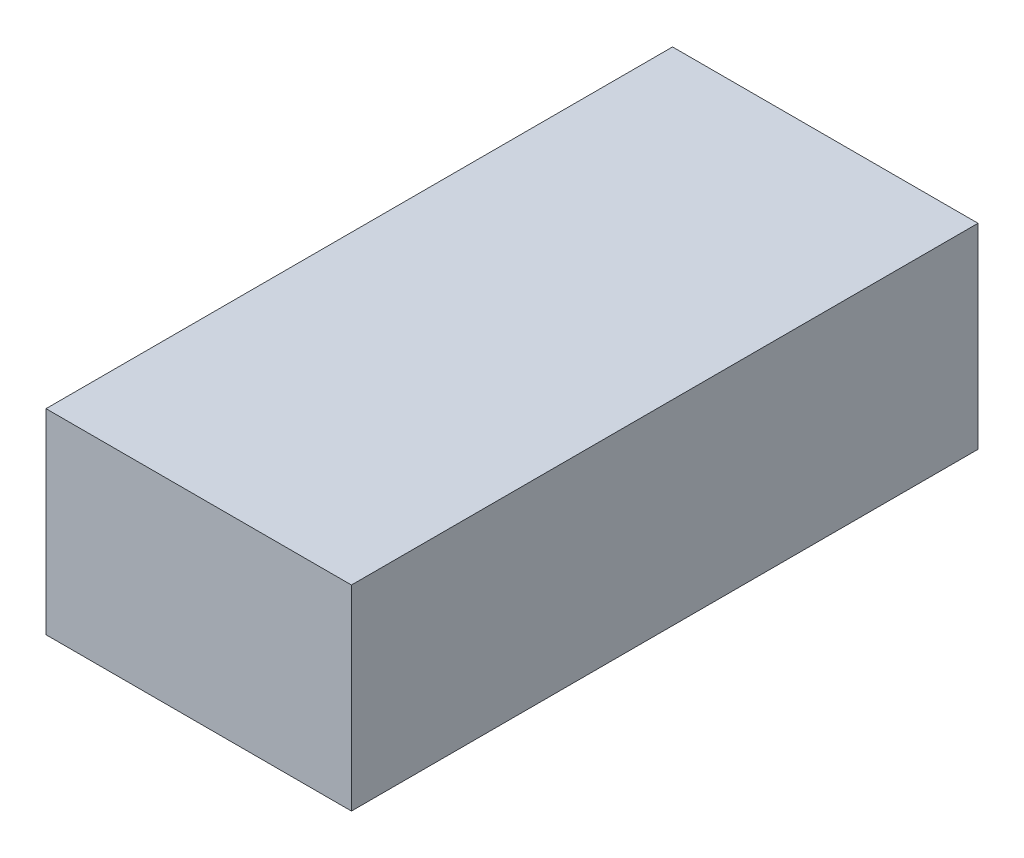
ISO-10303-21;
HEADER;
FILE_DESCRIPTION(('STEP AP214'),'2;1');
FILE_NAME('part.step','',(''),(''),'','','');
FILE_SCHEMA(('AUTOMOTIVE_DESIGN { 1 0 10303 214 1 1 1 1 }'));
ENDSEC;
DATA;
#1=APPLICATION_CONTEXT('core data for automotive mechanical design processes');
#2=APPLICATION_PROTOCOL_DEFINITION('international standard','automotive_design',2000,#1);
#3=PRODUCT_CONTEXT('',#1,'mechanical');
#4=PRODUCT('Part','Part','',(#3));
#5=PRODUCT_RELATED_PRODUCT_CATEGORY('part','',(#4));
#6=PRODUCT_DEFINITION_FORMATION('','',#4);
#7=PRODUCT_DEFINITION_CONTEXT('part definition',#1,'design');
#8=PRODUCT_DEFINITION('design','',#6,#7);
#9=PRODUCT_DEFINITION_SHAPE('','',#8);
#10=(LENGTH_UNIT() NAMED_UNIT(*) SI_UNIT(.MILLI.,.METRE.));
#11=(NAMED_UNIT(*) PLANE_ANGLE_UNIT() SI_UNIT($,.RADIAN.));
#12=(NAMED_UNIT(*) SI_UNIT($,.STERADIAN.) SOLID_ANGLE_UNIT());
#13=UNCERTAINTY_MEASURE_WITH_UNIT(LENGTH_MEASURE(1.E-05),#10,'distance_accuracy_value','');
#14=(GEOMETRIC_REPRESENTATION_CONTEXT(3) GLOBAL_UNCERTAINTY_ASSIGNED_CONTEXT((#13)) GLOBAL_UNIT_ASSIGNED_CONTEXT((#10,
#11,#12)) REPRESENTATION_CONTEXT('',''));
#15=CARTESIAN_POINT('',(0.,0.,0.));
#16=DIRECTION('',(0.,0.,1.));
#17=DIRECTION('',(1.,0.,0.));
#18=AXIS2_PLACEMENT_3D('',#15,#16,#17);
#19=CARTESIAN_POINT('',(-0.38999922,-0.2499995,1.59999934));
#20=DIRECTION('',(0.,0.,-1.));
#21=DIRECTION('',(0.,-1.,0.));
#22=AXIS2_PLACEMENT_3D('',#19,#20,#21);
#23=PLANE('',#22);
#24=DIRECTION('',(1.,0.,0.));
#25=VECTOR('',#24,1.);
#26=CARTESIAN_POINT('',(-0.38999922,-0.2499995,1.59999934));
#27=LINE('',#26,#25);
#28=CARTESIAN_POINT('',(-0.38999922,-0.2499995,1.59999934));
#29=VERTEX_POINT('',#28);
#30=CARTESIAN_POINT('',(0.38999922,-0.2499995,1.59999934));
#31=VERTEX_POINT('',#30);
#32=EDGE_CURVE('E79',#29,#31,#27,.T.);
#33=ORIENTED_EDGE('',*,*,#32,.T.);
#34=DIRECTION('',(0.,1.,0.));
#35=VECTOR('',#34,1.);
#36=CARTESIAN_POINT('',(0.38999922,-0.2499995,1.59999934));
#37=LINE('',#36,#35);
#38=CARTESIAN_POINT('',(0.38999922,0.2499995,1.59999934));
#39=VERTEX_POINT('',#38);
#40=EDGE_CURVE('E77',#31,#39,#37,.T.);
#41=ORIENTED_EDGE('',*,*,#40,.T.);
#42=DIRECTION('',(-1.,0.,0.));
#43=VECTOR('',#42,1.);
#44=CARTESIAN_POINT('',(0.38999922,0.2499995,1.59999934));
#45=LINE('',#44,#43);
#46=CARTESIAN_POINT('',(-0.38999922,0.2499995,1.59999934));
#47=VERTEX_POINT('',#46);
#48=EDGE_CURVE('E66',#39,#47,#45,.T.);
#49=ORIENTED_EDGE('',*,*,#48,.T.);
#50=DIRECTION('',(0.,-1.,0.));
#51=VECTOR('',#50,1.);
#52=CARTESIAN_POINT('',(-0.38999922,0.2499995,1.59999934));
#53=LINE('',#52,#51);
#54=EDGE_CURVE('E11',#47,#29,#53,.T.);
#55=ORIENTED_EDGE('',*,*,#54,.T.);
#56=EDGE_LOOP('',(#33,#41,#49,#55));
#57=FACE_BOUND('',#56,.T.);
#58=ADVANCED_FACE('F17',(#57),#23,.F.);
#59=CARTESIAN_POINT('',(-0.38999922,-0.2499995,0.));
#60=DIRECTION('',(0.,0.,-1.));
#61=DIRECTION('',(0.,-1.,0.));
#62=AXIS2_PLACEMENT_3D('',#59,#60,#61);
#63=PLANE('',#62);
#64=DIRECTION('',(0.,-1.,0.));
#65=VECTOR('',#64,1.);
#66=CARTESIAN_POINT('',(-0.38999922,0.2499995,0.));
#67=LINE('',#66,#65);
#68=CARTESIAN_POINT('',(-0.38999922,0.2499995,0.));
#69=VERTEX_POINT('',#68);
#70=CARTESIAN_POINT('',(-0.38999922,-0.2499995,0.));
#71=VERTEX_POINT('',#70);
#72=EDGE_CURVE('E28',#69,#71,#67,.T.);
#73=ORIENTED_EDGE('',*,*,#72,.F.);
#74=DIRECTION('',(-1.,0.,0.));
#75=VECTOR('',#74,1.);
#76=CARTESIAN_POINT('',(0.38999922,0.2499995,0.));
#77=LINE('',#76,#75);
#78=CARTESIAN_POINT('',(0.38999922,0.2499995,0.));
#79=VERTEX_POINT('',#78);
#80=EDGE_CURVE('E84',#79,#69,#77,.T.);
#81=ORIENTED_EDGE('',*,*,#80,.F.);
#82=DIRECTION('',(0.,1.,0.));
#83=VECTOR('',#82,1.);
#84=CARTESIAN_POINT('',(0.38999922,-0.2499995,0.));
#85=LINE('',#84,#83);
#86=CARTESIAN_POINT('',(0.38999922,-0.2499995,0.));
#87=VERTEX_POINT('',#86);
#88=EDGE_CURVE('E87',#87,#79,#85,.T.);
#89=ORIENTED_EDGE('',*,*,#88,.F.);
#90=DIRECTION('',(1.,0.,0.));
#91=VECTOR('',#90,1.);
#92=CARTESIAN_POINT('',(-0.38999922,-0.2499995,0.));
#93=LINE('',#92,#91);
#94=EDGE_CURVE('E101',#71,#87,#93,.T.);
#95=ORIENTED_EDGE('',*,*,#94,.F.);
#96=EDGE_LOOP('',(#73,#81,#89,#95));
#97=FACE_BOUND('',#96,.T.);
#98=ADVANCED_FACE('F116',(#97),#63,.T.);
#99=CARTESIAN_POINT('',(-0.38999922,0.2499995,0.));
#100=DIRECTION('',(1.,0.,0.));
#101=DIRECTION('',(0.,1.,0.));
#102=AXIS2_PLACEMENT_3D('',#99,#100,#101);
#103=PLANE('',#102);
#104=ORIENTED_EDGE('',*,*,#72,.T.);
#105=DIRECTION('',(0.,0.,1.));
#106=VECTOR('',#105,1.);
#107=CARTESIAN_POINT('',(-0.38999922,-0.2499995,0.));
#108=LINE('',#107,#106);
#109=EDGE_CURVE('E21',#71,#29,#108,.T.);
#110=ORIENTED_EDGE('',*,*,#109,.T.);
#111=ORIENTED_EDGE('',*,*,#54,.F.);
#112=DIRECTION('',(0.,0.,1.));
#113=VECTOR('',#112,1.);
#114=CARTESIAN_POINT('',(-0.38999922,0.2499995,0.));
#115=LINE('',#114,#113);
#116=EDGE_CURVE('E72',#69,#47,#115,.T.);
#117=ORIENTED_EDGE('',*,*,#116,.F.);
#118=EDGE_LOOP('',(#104,#110,#111,#117));
#119=FACE_BOUND('',#118,.T.);
#120=ADVANCED_FACE('F119',(#119),#103,.F.);
#121=CARTESIAN_POINT('',(0.38999922,0.2499995,0.));
#122=DIRECTION('',(0.,-1.,0.));
#123=DIRECTION('',(0.,0.,-1.));
#124=AXIS2_PLACEMENT_3D('',#121,#122,#123);
#125=PLANE('',#124);
#126=ORIENTED_EDGE('',*,*,#80,.T.);
#127=ORIENTED_EDGE('',*,*,#116,.T.);
#128=ORIENTED_EDGE('',*,*,#48,.F.);
#129=DIRECTION('',(0.,0.,1.));
#130=VECTOR('',#129,1.);
#131=CARTESIAN_POINT('',(0.38999922,0.2499995,0.));
#132=LINE('',#131,#130);
#133=EDGE_CURVE('E70',#79,#39,#132,.T.);
#134=ORIENTED_EDGE('',*,*,#133,.F.);
#135=EDGE_LOOP('',(#126,#127,#128,#134));
#136=FACE_BOUND('',#135,.T.);
#137=ADVANCED_FACE('F19',(#136),#125,.F.);
#138=CARTESIAN_POINT('',(0.38999922,-0.2499995,0.));
#139=DIRECTION('',(-1.,0.,0.));
#140=DIRECTION('',(0.,0.,1.));
#141=AXIS2_PLACEMENT_3D('',#138,#139,#140);
#142=PLANE('',#141);
#143=ORIENTED_EDGE('',*,*,#88,.T.);
#144=ORIENTED_EDGE('',*,*,#133,.T.);
#145=ORIENTED_EDGE('',*,*,#40,.F.);
#146=DIRECTION('',(0.,0.,1.));
#147=VECTOR('',#146,1.);
#148=CARTESIAN_POINT('',(0.38999922,-0.2499995,0.));
#149=LINE('',#148,#147);
#150=EDGE_CURVE('E95',#87,#31,#149,.T.);
#151=ORIENTED_EDGE('',*,*,#150,.F.);
#152=EDGE_LOOP('',(#143,#144,#145,#151));
#153=FACE_BOUND('',#152,.T.);
#154=ADVANCED_FACE('F86',(#153),#142,.F.);
#155=CARTESIAN_POINT('',(-0.38999922,-0.2499995,0.));
#156=DIRECTION('',(0.,1.,0.));
#157=DIRECTION('',(1.,0.,0.));
#158=AXIS2_PLACEMENT_3D('',#155,#156,#157);
#159=PLANE('',#158);
#160=ORIENTED_EDGE('',*,*,#94,.T.);
#161=ORIENTED_EDGE('',*,*,#150,.T.);
#162=ORIENTED_EDGE('',*,*,#32,.F.);
#163=ORIENTED_EDGE('',*,*,#109,.F.);
#164=EDGE_LOOP('',(#160,#161,#162,#163));
#165=FACE_BOUND('',#164,.T.);
#166=ADVANCED_FACE('F112',(#165),#159,.F.);
#167=CLOSED_SHELL('',(#58,#98,#120,#137,#154,#166));
#168=MANIFOLD_SOLID_BREP('B1',#167);
#169=ADVANCED_BREP_SHAPE_REPRESENTATION('',(#18,#168),#14);
#170=SHAPE_DEFINITION_REPRESENTATION(#9,#169);
ENDSEC;
END-ISO-10303-21;
